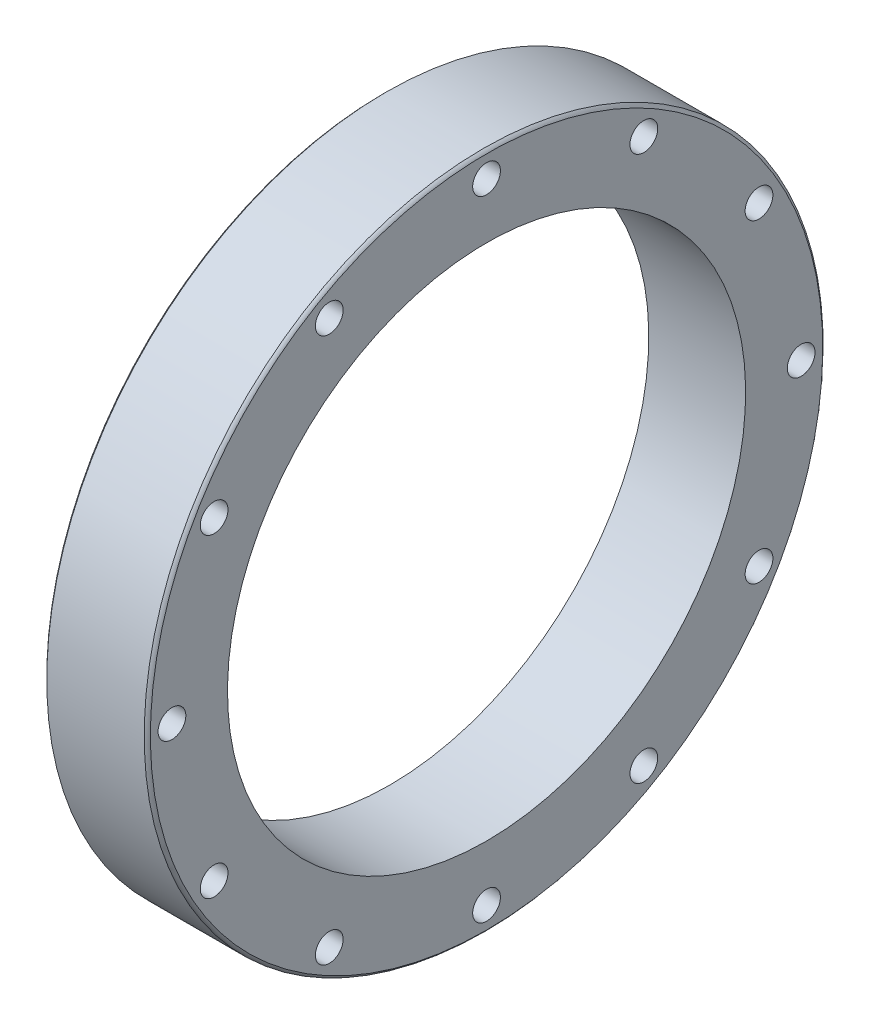
ISO-10303-21;
HEADER;
FILE_DESCRIPTION(('STEP AP214'),'2;1');
FILE_NAME('part.step','',(''),(''),'','','');
FILE_SCHEMA(('AUTOMOTIVE_DESIGN { 1 0 10303 214 1 1 1 1 }'));
ENDSEC;
DATA;
#1=APPLICATION_CONTEXT('core data for automotive mechanical design processes');
#2=APPLICATION_PROTOCOL_DEFINITION('international standard','automotive_design',2000,#1);
#3=PRODUCT_CONTEXT('',#1,'mechanical');
#4=PRODUCT('Part','Part','',(#3));
#5=PRODUCT_RELATED_PRODUCT_CATEGORY('part','',(#4));
#6=PRODUCT_DEFINITION_FORMATION('','',#4);
#7=PRODUCT_DEFINITION_CONTEXT('part definition',#1,'design');
#8=PRODUCT_DEFINITION('design','',#6,#7);
#9=PRODUCT_DEFINITION_SHAPE('','',#8);
#10=(LENGTH_UNIT() NAMED_UNIT(*) SI_UNIT(.MILLI.,.METRE.));
#11=(NAMED_UNIT(*) PLANE_ANGLE_UNIT() SI_UNIT($,.RADIAN.));
#12=(NAMED_UNIT(*) SI_UNIT($,.STERADIAN.) SOLID_ANGLE_UNIT());
#13=UNCERTAINTY_MEASURE_WITH_UNIT(LENGTH_MEASURE(1.E-05),#10,'distance_accuracy_value','');
#14=(GEOMETRIC_REPRESENTATION_CONTEXT(3) GLOBAL_UNCERTAINTY_ASSIGNED_CONTEXT((#13)) GLOBAL_UNIT_ASSIGNED_CONTEXT((#10,
#11,#12)) REPRESENTATION_CONTEXT('',''));
#15=CARTESIAN_POINT('',(0.,0.,0.));
#16=DIRECTION('',(0.,0.,1.));
#17=DIRECTION('',(1.,0.,0.));
#18=AXIS2_PLACEMENT_3D('',#15,#16,#17);
#19=CARTESIAN_POINT('',(-0.0100000000000013,0.,0.));
#20=DIRECTION('',(1.,0.,0.));
#21=DIRECTION('',(0.,0.,-1.));
#22=AXIS2_PLACEMENT_3D('',#19,#20,#21);
#23=CYLINDRICAL_SURFACE('',#22,41.9998270383694);
#24=CARTESIAN_POINT('',(0.999826901443189,0.,0.));
#25=DIRECTION('',(-1.,0.,0.));
#26=DIRECTION('',(0.,-1.,0.));
#27=AXIS2_PLACEMENT_3D('',#24,#25,#26);
#28=CIRCLE('',#27,41.9998270383694);
#29=CARTESIAN_POINT('',(0.999826901443194,-41.9998270383694,0.));
#30=VERTEX_POINT('',#29);
#31=EDGE_CURVE('E10',#30,#30,#28,.T.);
#32=ORIENTED_EDGE('',*,*,#31,.T.);
#33=EDGE_LOOP('',(#32));
#34=FACE_BOUND('',#33,.T.);
#35=CARTESIAN_POINT('',(16.6999999999792,0.,0.));
#36=DIRECTION('',(-1.,0.,0.));
#37=DIRECTION('',(0.,-1.,0.));
#38=AXIS2_PLACEMENT_3D('',#35,#36,#37);
#39=CIRCLE('',#38,41.9998270383694);
#40=CARTESIAN_POINT('',(16.6999999999792,-41.9998270383694,0.));
#41=VERTEX_POINT('',#40);
#42=EDGE_CURVE('E42',#41,#41,#39,.T.);
#43=ORIENTED_EDGE('',*,*,#42,.F.);
#44=EDGE_LOOP('',(#43));
#45=FACE_BOUND('',#44,.T.);
#46=ADVANCED_FACE('F32',(#34,#45),#23,.F.);
#47=CARTESIAN_POINT('',(0.,0.,0.));
#48=DIRECTION('',(-1.,0.,0.));
#49=DIRECTION('',(0.,-1.,0.));
#50=AXIS2_PLACEMENT_3D('',#47,#48,#49);
#51=CONICAL_SURFACE('',#50,43.9998270710618,0.785156092085935);
#52=CARTESIAN_POINT('',(0.499767872942841,0.,0.));
#53=DIRECTION('',(-1.,0.,0.));
#54=DIRECTION('',(0.,-1.,0.));
#55=AXIS2_PLACEMENT_3D('',#52,#53,#54);
#56=CIRCLE('',#55,43.5003010984954);
#57=CARTESIAN_POINT('',(0.499767872942847,-43.5003010984954,0.));
#58=VERTEX_POINT('',#57);
#59=EDGE_CURVE('E144',#58,#58,#56,.T.);
#60=ORIENTED_EDGE('',*,*,#59,.F.);
#61=EDGE_LOOP('',(#60));
#62=FACE_BOUND('',#61,.T.);
#63=CARTESIAN_POINT('',(0.,0.,0.));
#64=DIRECTION('',(-1.,0.,0.));
#65=DIRECTION('',(0.,-1.,0.));
#66=AXIS2_PLACEMENT_3D('',#63,#64,#65);
#67=CIRCLE('',#66,43.9998270710618);
#68=CARTESIAN_POINT('',(0.,-43.9998270710618,0.));
#69=VERTEX_POINT('',#68);
#70=EDGE_CURVE('E141',#69,#69,#67,.T.);
#71=ORIENTED_EDGE('',*,*,#70,.T.);
#72=EDGE_LOOP('',(#71));
#73=FACE_BOUND('',#72,.T.);
#74=ADVANCED_FACE('F234',(#62,#73),#51,.F.);
#75=CARTESIAN_POINT('',(-5.09999999999966,0.,0.));
#76=DIRECTION('',(-1.,0.,0.));
#77=DIRECTION('',(0.,-1.,0.));
#78=AXIS2_PLACEMENT_3D('',#75,#76,#77);
#79=CYLINDRICAL_SURFACE('',#78,43.5003010984954);
#80=CARTESIAN_POINT('',(3.45828430385802,0.,0.));
#81=DIRECTION('',(-1.,0.,0.));
#82=DIRECTION('',(0.,-1.,0.));
#83=AXIS2_PLACEMENT_3D('',#80,#81,#82);
#84=CIRCLE('',#83,43.5003010984954);
#85=CARTESIAN_POINT('',(3.45828430385802,-43.5003010984954,0.));
#86=VERTEX_POINT('',#85);
#87=EDGE_CURVE('E199',#86,#86,#84,.T.);
#88=ORIENTED_EDGE('',*,*,#87,.F.);
#89=EDGE_LOOP('',(#88));
#90=FACE_BOUND('',#89,.T.);
#91=ORIENTED_EDGE('',*,*,#59,.T.);
#92=EDGE_LOOP('',(#91));
#93=FACE_BOUND('',#92,.T.);
#94=ADVANCED_FACE('F238',(#90,#93),#79,.F.);
#95=CARTESIAN_POINT('',(3.45828430385802,0.,0.));
#96=DIRECTION('',(1.,0.,0.));
#97=DIRECTION('',(0.,1.,0.));
#98=AXIS2_PLACEMENT_3D('',#95,#96,#97);
#99=CONICAL_SURFACE('',#98,43.5003010984954,0.785427669859749);
#100=ORIENTED_EDGE('',*,*,#87,.T.);
#101=EDGE_LOOP('',(#100));
#102=FACE_BOUND('',#101,.T.);
#103=CARTESIAN_POINT('',(3.16999271419257,0.,0.));
#104=DIRECTION('',(1.,0.,0.));
#105=DIRECTION('',(0.,1.,0.));
#106=AXIS2_PLACEMENT_3D('',#103,#104,#105);
#107=CIRCLE('',#106,43.2119924953981);
#108=CARTESIAN_POINT('',(3.16999271419256,43.2119924953981,0.));
#109=VERTEX_POINT('',#108);
#110=EDGE_CURVE('E202',#109,#109,#107,.T.);
#111=ORIENTED_EDGE('',*,*,#110,.T.);
#112=EDGE_LOOP('',(#111));
#113=FACE_BOUND('',#112,.T.);
#114=ADVANCED_FACE('F213',(#102,#113),#99,.T.);
#115=CARTESIAN_POINT('',(3.38213100772368,0.,0.));
#116=DIRECTION('',(-1.,0.,0.));
#117=DIRECTION('',(0.,-1.,0.));
#118=AXIS2_PLACEMENT_3D('',#115,#116,#117);
#119=TOROIDAL_SURFACE('',#118,42.9998667203988,0.300000000002287);
#120=CARTESIAN_POINT('',(3.16999271419257,0.,0.));
#121=DIRECTION('',(-1.,0.,0.));
#122=DIRECTION('',(0.,-1.,0.));
#123=AXIS2_PLACEMENT_3D('',#120,#121,#122);
#124=CIRCLE('',#123,42.7877409453994);
#125=CARTESIAN_POINT('',(3.16999271419257,-42.7877409453994,0.));
#126=VERTEX_POINT('',#125);
#127=EDGE_CURVE('E205',#126,#126,#124,.F.);
#128=ORIENTED_EDGE('',*,*,#127,.T.);
#129=EDGE_LOOP('',(#128));
#130=FACE_BOUND('',#129,.T.);
#131=ORIENTED_EDGE('',*,*,#110,.F.);
#132=EDGE_LOOP('',(#131));
#133=FACE_BOUND('',#132,.T.);
#134=ADVANCED_FACE('F208',(#130,#133),#119,.T.);
#135=CARTESIAN_POINT('',(3.16999271419256,0.,0.));
#136=DIRECTION('',(-1.,0.,0.));
#137=DIRECTION('',(0.,-1.,0.));
#138=AXIS2_PLACEMENT_3D('',#135,#136,#137);
#139=CONICAL_SURFACE('',#138,42.7877409453994,0.785427669859771);
#140=CARTESIAN_POINT('',(3.45828430385801,0.,0.));
#141=DIRECTION('',(-1.,0.,0.));
#142=DIRECTION('',(0.,-1.,0.));
#143=AXIS2_PLACEMENT_3D('',#140,#141,#142);
#144=CIRCLE('',#143,42.4994323423021);
#145=CARTESIAN_POINT('',(3.45828430385802,-42.4994323423021,0.));
#146=VERTEX_POINT('',#145);
#147=EDGE_CURVE('E50',#146,#146,#144,.T.);
#148=ORIENTED_EDGE('',*,*,#147,.F.);
#149=EDGE_LOOP('',(#148));
#150=FACE_BOUND('',#149,.T.);
#151=ORIENTED_EDGE('',*,*,#127,.F.);
#152=EDGE_LOOP('',(#151));
#153=FACE_BOUND('',#152,.T.);
#154=ADVANCED_FACE('F212',(#150,#153),#139,.F.);
#155=CARTESIAN_POINT('',(-5.09999999999966,0.,0.));
#156=DIRECTION('',(-1.,0.,0.));
#157=DIRECTION('',(0.,-1.,0.));
#158=AXIS2_PLACEMENT_3D('',#155,#156,#157);
#159=CYLINDRICAL_SURFACE('',#158,42.4994323423021);
#160=CARTESIAN_POINT('',(0.999826901443188,0.,0.));
#161=DIRECTION('',(-1.,0.,0.));
#162=DIRECTION('',(0.,-1.,0.));
#163=AXIS2_PLACEMENT_3D('',#160,#161,#162);
#164=CIRCLE('',#163,42.4994323423021);
#165=CARTESIAN_POINT('',(0.999826901443193,-42.4994323423021,0.));
#166=VERTEX_POINT('',#165);
#167=EDGE_CURVE('E145',#166,#166,#164,.F.);
#168=ORIENTED_EDGE('',*,*,#167,.T.);
#169=EDGE_LOOP('',(#168));
#170=FACE_BOUND('',#169,.T.);
#171=ORIENTED_EDGE('',*,*,#147,.T.);
#172=EDGE_LOOP('',(#171));
#173=FACE_BOUND('',#172,.T.);
#174=ADVANCED_FACE('F218',(#170,#173),#159,.T.);
#175=CARTESIAN_POINT('',(0.999826901443189,0.,0.));
#176=DIRECTION('',(-1.,0.,0.));
#177=DIRECTION('',(0.,-1.,0.));
#178=AXIS2_PLACEMENT_3D('',#175,#176,#177);
#179=PLANE('',#178);
#180=ORIENTED_EDGE('',*,*,#31,.F.);
#181=EDGE_LOOP('',(#180));
#182=FACE_BOUND('',#181,.T.);
#183=ORIENTED_EDGE('',*,*,#167,.F.);
#184=EDGE_LOOP('',(#183));
#185=FACE_BOUND('',#184,.T.);
#186=ADVANCED_FACE('F221',(#182,#185),#179,.T.);
#187=CARTESIAN_POINT('',(0.,0.,0.));
#188=DIRECTION('',(1.,0.,0.));
#189=DIRECTION('',(0.,1.,0.));
#190=AXIS2_PLACEMENT_3D('',#187,#188,#189);
#191=PLANE('',#190);
#192=CARTESIAN_POINT('',(0.,0.,0.));
#193=DIRECTION('',(-1.,0.,0.));
#194=DIRECTION('',(0.,-1.,0.));
#195=AXIS2_PLACEMENT_3D('',#192,#193,#194);
#196=CIRCLE('',#195,44.9998270710616);
#197=CARTESIAN_POINT('',(0.,-44.9998270710616,0.));
#198=VERTEX_POINT('',#197);
#199=EDGE_CURVE('E138',#198,#198,#196,.F.);
#200=ORIENTED_EDGE('',*,*,#199,.F.);
#201=EDGE_LOOP('',(#200));
#202=FACE_BOUND('',#201,.T.);
#203=ORIENTED_EDGE('',*,*,#70,.F.);
#204=EDGE_LOOP('',(#203));
#205=FACE_BOUND('',#204,.T.);
#206=ADVANCED_FACE('F224',(#202,#205),#191,.F.);
#207=CARTESIAN_POINT('',(-5.09999999999966,0.,0.));
#208=DIRECTION('',(-1.,0.,0.));
#209=DIRECTION('',(0.,-1.,0.));
#210=AXIS2_PLACEMENT_3D('',#207,#208,#209);
#211=CYLINDRICAL_SURFACE('',#210,44.9998270710616);
#212=ORIENTED_EDGE('',*,*,#199,.T.);
#213=EDGE_LOOP('',(#212));
#214=FACE_BOUND('',#213,.T.);
#215=CARTESIAN_POINT('',(1.3500000000013,0.,0.));
#216=DIRECTION('',(-1.,0.,0.));
#217=DIRECTION('',(0.,-1.,0.));
#218=AXIS2_PLACEMENT_3D('',#215,#216,#217);
#219=CIRCLE('',#218,44.9998270710616);
#220=CARTESIAN_POINT('',(1.3500000000013,-44.9998270710616,0.));
#221=VERTEX_POINT('',#220);
#222=EDGE_CURVE('E135',#221,#221,#219,.T.);
#223=ORIENTED_EDGE('',*,*,#222,.T.);
#224=EDGE_LOOP('',(#223));
#225=FACE_BOUND('',#224,.T.);
#226=ADVANCED_FACE('F229',(#214,#225),#211,.T.);
#227=CARTESIAN_POINT('',(1.3500000000013,0.,0.));
#228=DIRECTION('',(1.,0.,0.));
#229=DIRECTION('',(0.,1.,0.));
#230=AXIS2_PLACEMENT_3D('',#227,#228,#229);
#231=PLANE('',#230);
#232=CARTESIAN_POINT('',(1.3500000000013,0.,0.));
#233=DIRECTION('',(-1.,0.,0.));
#234=DIRECTION('',(0.,-1.,0.));
#235=AXIS2_PLACEMENT_3D('',#232,#233,#234);
#236=CIRCLE('',#235,47.3998270710615);
#237=CARTESIAN_POINT('',(1.35000000000131,-47.3998270710615,0.));
#238=VERTEX_POINT('',#237);
#239=EDGE_CURVE('E132',#238,#238,#236,.T.);
#240=ORIENTED_EDGE('',*,*,#239,.T.);
#241=EDGE_LOOP('',(#240));
#242=FACE_BOUND('',#241,.T.);
#243=ORIENTED_EDGE('',*,*,#222,.F.);
#244=EDGE_LOOP('',(#243));
#245=FACE_BOUND('',#244,.T.);
#246=ADVANCED_FACE('F333',(#242,#245),#231,.F.);
#247=CARTESIAN_POINT('',(-5.09999999999966,0.,0.));
#248=DIRECTION('',(-1.,0.,0.));
#249=DIRECTION('',(0.,-1.,0.));
#250=AXIS2_PLACEMENT_3D('',#247,#248,#249);
#251=CYLINDRICAL_SURFACE('',#250,47.3998270710615);
#252=CARTESIAN_POINT('',(0.,0.,0.));
#253=DIRECTION('',(-1.,0.,0.));
#254=DIRECTION('',(0.,-1.,0.));
#255=AXIS2_PLACEMENT_3D('',#252,#253,#254);
#256=CIRCLE('',#255,47.3998270710615);
#257=CARTESIAN_POINT('',(0.,-47.3998270710615,0.));
#258=VERTEX_POINT('',#257);
#259=EDGE_CURVE('E129',#258,#258,#256,.F.);
#260=ORIENTED_EDGE('',*,*,#259,.F.);
#261=EDGE_LOOP('',(#260));
#262=FACE_BOUND('',#261,.T.);
#263=ORIENTED_EDGE('',*,*,#239,.F.);
#264=EDGE_LOOP('',(#263));
#265=FACE_BOUND('',#264,.T.);
#266=ADVANCED_FACE('F329',(#262,#265),#251,.F.);
#267=CARTESIAN_POINT('',(0.400000000000738,0.,0.));
#268=DIRECTION('',(1.,0.,0.));
#269=DIRECTION('',(0.,1.,0.));
#270=AXIS2_PLACEMENT_3D('',#267,#268,#269);
#271=CONICAL_SURFACE('',#270,54.9998270710621,0.785398163397448);
#272=CARTESIAN_POINT('',(0.,0.,0.));
#273=DIRECTION('',(1.,0.,0.));
#274=DIRECTION('',(0.,1.,0.));
#275=AXIS2_PLACEMENT_3D('',#272,#273,#274);
#276=CIRCLE('',#275,54.5998270710614);
#277=CARTESIAN_POINT('',(0.,54.5998270710614,0.));
#278=VERTEX_POINT('',#277);
#279=EDGE_CURVE('E126',#278,#278,#276,.F.);
#280=ORIENTED_EDGE('',*,*,#279,.F.);
#281=EDGE_LOOP('',(#280));
#282=FACE_BOUND('',#281,.T.);
#283=CARTESIAN_POINT('',(0.400000000000737,0.,0.));
#284=DIRECTION('',(-1.,0.,0.));
#285=DIRECTION('',(0.,-1.,0.));
#286=AXIS2_PLACEMENT_3D('',#283,#284,#285);
#287=CIRCLE('',#286,54.9998270710621);
#288=CARTESIAN_POINT('',(0.400000000000743,-54.9998270710621,0.));
#289=VERTEX_POINT('',#288);
#290=EDGE_CURVE('E125',#289,#289,#287,.F.);
#291=ORIENTED_EDGE('',*,*,#290,.F.);
#292=EDGE_LOOP('',(#291));
#293=FACE_BOUND('',#292,.T.);
#294=ADVANCED_FACE('F280',(#282,#293),#271,.T.);
#295=CARTESIAN_POINT('',(0.,0.,0.));
#296=DIRECTION('',(-1.,0.,0.));
#297=DIRECTION('',(0.,-1.,0.));
#298=AXIS2_PLACEMENT_3D('',#295,#296,#297);
#299=PLANE('',#298);
#300=CARTESIAN_POINT('',(0.,44.1672955930067,25.4999999999994));
#301=DIRECTION('',(1.,0.,0.));
#302=DIRECTION('',(0.,0.,-1.));
#303=AXIS2_PLACEMENT_3D('',#300,#301,#302);
#304=CIRCLE('',#303,2.25);
#305=CARTESIAN_POINT('',(0.,44.1672955930067,23.2499999999994));
#306=VERTEX_POINT('',#305);
#307=EDGE_CURVE('E122',#306,#306,#304,.T.);
#308=ORIENTED_EDGE('',*,*,#307,.T.);
#309=EDGE_LOOP('',(#308));
#310=FACE_BOUND('',#309,.T.);
#311=CARTESIAN_POINT('',(0.,25.5000000000005,44.1672955930061));
#312=DIRECTION('',(1.,0.,0.));
#313=DIRECTION('',(0.,0.,-1.));
#314=AXIS2_PLACEMENT_3D('',#311,#312,#313);
#315=CIRCLE('',#314,2.25);
#316=CARTESIAN_POINT('',(0.,25.5000000000005,41.9172955930061));
#317=VERTEX_POINT('',#316);
#318=EDGE_CURVE('E119',#317,#317,#315,.T.);
#319=ORIENTED_EDGE('',*,*,#318,.T.);
#320=EDGE_LOOP('',(#319));
#321=FACE_BOUND('',#320,.T.);
#322=CARTESIAN_POINT('',(0.,-25.4999999999996,44.1672955930066));
#323=DIRECTION('',(1.,0.,0.));
#324=DIRECTION('',(0.,0.,-1.));
#325=AXIS2_PLACEMENT_3D('',#322,#323,#324);
#326=CIRCLE('',#325,2.25);
#327=CARTESIAN_POINT('',(0.,-25.4999999999996,41.9172955930066));
#328=VERTEX_POINT('',#327);
#329=EDGE_CURVE('E113',#328,#328,#326,.T.);
#330=ORIENTED_EDGE('',*,*,#329,.T.);
#331=EDGE_LOOP('',(#330));
#332=FACE_BOUND('',#331,.T.);
#333=CARTESIAN_POINT('',(0.,-51.,0.));
#334=DIRECTION('',(1.,0.,0.));
#335=DIRECTION('',(0.,0.,-1.));
#336=AXIS2_PLACEMENT_3D('',#333,#334,#335);
#337=CIRCLE('',#336,2.25);
#338=CARTESIAN_POINT('',(0.,-51.,-2.25));
#339=VERTEX_POINT('',#338);
#340=EDGE_CURVE('E107',#339,#339,#337,.T.);
#341=ORIENTED_EDGE('',*,*,#340,.T.);
#342=EDGE_LOOP('',(#341));
#343=FACE_BOUND('',#342,.T.);
#344=CARTESIAN_POINT('',(0.,-25.5000000000002,-44.1672955930063));
#345=DIRECTION('',(1.,0.,0.));
#346=DIRECTION('',(0.,0.,-1.));
#347=AXIS2_PLACEMENT_3D('',#344,#345,#346);
#348=CIRCLE('',#347,2.25);
#349=CARTESIAN_POINT('',(0.,-25.5000000000002,-46.4172955930063));
#350=VERTEX_POINT('',#349);
#351=EDGE_CURVE('E101',#350,#350,#348,.T.);
#352=ORIENTED_EDGE('',*,*,#351,.T.);
#353=EDGE_LOOP('',(#352));
#354=FACE_BOUND('',#353,.T.);
#355=CARTESIAN_POINT('',(0.,-1.76240040415972E-13,-51.));
#356=DIRECTION('',(1.,0.,0.));
#357=DIRECTION('',(0.,0.,-1.));
#358=AXIS2_PLACEMENT_3D('',#355,#356,#357);
#359=CIRCLE('',#358,2.25);
#360=CARTESIAN_POINT('',(0.,-1.76240040415972E-13,-53.25));
#361=VERTEX_POINT('',#360);
#362=EDGE_CURVE('E98',#361,#361,#359,.T.);
#363=ORIENTED_EDGE('',*,*,#362,.T.);
#364=EDGE_LOOP('',(#363));
#365=FACE_BOUND('',#364,.T.);
#366=CARTESIAN_POINT('',(0.,25.4999999999999,-44.1672955930064));
#367=DIRECTION('',(1.,0.,0.));
#368=DIRECTION('',(0.,0.,-1.));
#369=AXIS2_PLACEMENT_3D('',#366,#367,#368);
#370=CIRCLE('',#369,2.25);
#371=CARTESIAN_POINT('',(0.,25.4999999999999,-46.4172955930064));
#372=VERTEX_POINT('',#371);
#373=EDGE_CURVE('E95',#372,#372,#370,.T.);
#374=ORIENTED_EDGE('',*,*,#373,.T.);
#375=EDGE_LOOP('',(#374));
#376=FACE_BOUND('',#375,.T.);
#377=CARTESIAN_POINT('',(0.,44.1672955930064,-25.5));
#378=DIRECTION('',(1.,0.,0.));
#379=DIRECTION('',(0.,0.,-1.));
#380=AXIS2_PLACEMENT_3D('',#377,#378,#379);
#381=CIRCLE('',#380,2.25);
#382=CARTESIAN_POINT('',(0.,44.1672955930064,-27.75));
#383=VERTEX_POINT('',#382);
#384=EDGE_CURVE('E92',#383,#383,#381,.T.);
#385=ORIENTED_EDGE('',*,*,#384,.T.);
#386=EDGE_LOOP('',(#385));
#387=FACE_BOUND('',#386,.T.);
#388=CARTESIAN_POINT('',(0.,51.,0.));
#389=DIRECTION('',(1.,0.,0.));
#390=DIRECTION('',(0.,0.,-1.));
#391=AXIS2_PLACEMENT_3D('',#388,#389,#390);
#392=CIRCLE('',#391,2.25);
#393=CARTESIAN_POINT('',(0.,51.,-2.25));
#394=VERTEX_POINT('',#393);
#395=EDGE_CURVE('E89',#394,#394,#392,.T.);
#396=ORIENTED_EDGE('',*,*,#395,.T.);
#397=EDGE_LOOP('',(#396));
#398=FACE_BOUND('',#397,.T.);
#399=ORIENTED_EDGE('',*,*,#279,.T.);
#400=EDGE_LOOP('',(#399));
#401=FACE_BOUND('',#400,.T.);
#402=ORIENTED_EDGE('',*,*,#259,.T.);
#403=EDGE_LOOP('',(#402));
#404=FACE_BOUND('',#403,.T.);
#405=CARTESIAN_POINT('',(0.,-44.1672955930065,-25.4999999999997));
#406=DIRECTION('',(1.,0.,0.));
#407=DIRECTION('',(0.,0.,-1.));
#408=AXIS2_PLACEMENT_3D('',#405,#406,#407);
#409=CIRCLE('',#408,2.25);
#410=CARTESIAN_POINT('',(0.,-44.1672955930065,-27.7499999999997));
#411=VERTEX_POINT('',#410);
#412=EDGE_CURVE('E104',#411,#411,#409,.T.);
#413=ORIENTED_EDGE('',*,*,#412,.T.);
#414=EDGE_LOOP('',(#413));
#415=FACE_BOUND('',#414,.T.);
#416=CARTESIAN_POINT('',(0.,-44.1672955930062,25.5000000000004));
#417=DIRECTION('',(1.,0.,0.));
#418=DIRECTION('',(0.,0.,-1.));
#419=AXIS2_PLACEMENT_3D('',#416,#417,#418);
#420=CIRCLE('',#419,2.25);
#421=CARTESIAN_POINT('',(0.,-44.1672955930062,23.2500000000004));
#422=VERTEX_POINT('',#421);
#423=EDGE_CURVE('E110',#422,#422,#420,.T.);
#424=ORIENTED_EDGE('',*,*,#423,.T.);
#425=EDGE_LOOP('',(#424));
#426=FACE_BOUND('',#425,.T.);
#427=CARTESIAN_POINT('',(0.,5.36022152708027E-13,51.));
#428=DIRECTION('',(1.,0.,0.));
#429=DIRECTION('',(0.,0.,-1.));
#430=AXIS2_PLACEMENT_3D('',#427,#428,#429);
#431=CIRCLE('',#430,2.25);
#432=CARTESIAN_POINT('',(0.,5.36022152708027E-13,48.75));
#433=VERTEX_POINT('',#432);
#434=EDGE_CURVE('E116',#433,#433,#431,.T.);
#435=ORIENTED_EDGE('',*,*,#434,.T.);
#436=EDGE_LOOP('',(#435));
#437=FACE_BOUND('',#436,.T.);
#438=ADVANCED_FACE('F277',(#310,#321,#332,#343,#354,#365,#376,#387,#398,#401,#404,#415,#426,
#437),#299,.T.);
#439=CARTESIAN_POINT('',(-5.09999999999966,0.,0.));
#440=DIRECTION('',(-1.,0.,0.));
#441=DIRECTION('',(0.,-1.,0.));
#442=AXIS2_PLACEMENT_3D('',#439,#440,#441);
#443=CYLINDRICAL_SURFACE('',#442,54.9998270710621);
#444=CARTESIAN_POINT('',(16.1999999999919,0.,0.));
#445=DIRECTION('',(-1.,0.,0.));
#446=DIRECTION('',(0.,-1.,0.));
#447=AXIS2_PLACEMENT_3D('',#444,#445,#446);
#448=CIRCLE('',#447,54.9998270710621);
#449=CARTESIAN_POINT('',(16.1999999999919,-54.9998270710621,0.));
#450=VERTEX_POINT('',#449);
#451=EDGE_CURVE('E88',#450,#450,#448,.F.);
#452=ORIENTED_EDGE('',*,*,#451,.F.);
#453=EDGE_LOOP('',(#452));
#454=FACE_BOUND('',#453,.T.);
#455=ORIENTED_EDGE('',*,*,#290,.T.);
#456=EDGE_LOOP('',(#455));
#457=FACE_BOUND('',#456,.T.);
#458=ADVANCED_FACE('F273',(#454,#457),#443,.T.);
#459=CARTESIAN_POINT('',(16.6999999999792,44.1672955930067,25.4999999999994));
#460=DIRECTION('',(1.,0.,0.));
#461=DIRECTION('',(0.,0.,-1.));
#462=AXIS2_PLACEMENT_3D('',#459,#460,#461);
#463=CYLINDRICAL_SURFACE('',#462,2.25);
#464=CARTESIAN_POINT('',(16.6999999999792,44.1672955930067,25.4999999999994));
#465=DIRECTION('',(1.,0.,0.));
#466=DIRECTION('',(0.,0.,-1.));
#467=AXIS2_PLACEMENT_3D('',#464,#465,#466);
#468=CIRCLE('',#467,2.25);
#469=CARTESIAN_POINT('',(16.6999999999792,44.1672955930067,23.2499999999994));
#470=VERTEX_POINT('',#469);
#471=EDGE_CURVE('E85',#470,#470,#468,.F.);
#472=ORIENTED_EDGE('',*,*,#471,.F.);
#473=EDGE_LOOP('',(#472));
#474=FACE_BOUND('',#473,.T.);
#475=ORIENTED_EDGE('',*,*,#307,.F.);
#476=EDGE_LOOP('',(#475));
#477=FACE_BOUND('',#476,.T.);
#478=ADVANCED_FACE('F269',(#474,#477),#463,.F.);
#479=CARTESIAN_POINT('',(16.6999999999792,25.5000000000005,44.1672955930061));
#480=DIRECTION('',(1.,0.,0.));
#481=DIRECTION('',(0.,0.,-1.));
#482=AXIS2_PLACEMENT_3D('',#479,#480,#481);
#483=CYLINDRICAL_SURFACE('',#482,2.25);
#484=CARTESIAN_POINT('',(16.6999999999792,25.5000000000005,44.1672955930061));
#485=DIRECTION('',(1.,0.,0.));
#486=DIRECTION('',(0.,0.,-1.));
#487=AXIS2_PLACEMENT_3D('',#484,#485,#486);
#488=CIRCLE('',#487,2.25);
#489=CARTESIAN_POINT('',(16.6999999999792,25.5000000000005,41.9172955930061));
#490=VERTEX_POINT('',#489);
#491=EDGE_CURVE('E82',#490,#490,#488,.F.);
#492=ORIENTED_EDGE('',*,*,#491,.F.);
#493=EDGE_LOOP('',(#492));
#494=FACE_BOUND('',#493,.T.);
#495=ORIENTED_EDGE('',*,*,#318,.F.);
#496=EDGE_LOOP('',(#495));
#497=FACE_BOUND('',#496,.T.);
#498=ADVANCED_FACE('F272',(#494,#497),#483,.F.);
#499=CARTESIAN_POINT('',(16.6999999999792,5.36022152708027E-13,51.));
#500=DIRECTION('',(1.,0.,0.));
#501=DIRECTION('',(0.,0.,-1.));
#502=AXIS2_PLACEMENT_3D('',#499,#500,#501);
#503=CYLINDRICAL_SURFACE('',#502,2.25);
#504=CARTESIAN_POINT('',(16.6999999999792,5.36022152708027E-13,51.));
#505=DIRECTION('',(1.,0.,0.));
#506=DIRECTION('',(0.,0.,-1.));
#507=AXIS2_PLACEMENT_3D('',#504,#505,#506);
#508=CIRCLE('',#507,2.25);
#509=CARTESIAN_POINT('',(16.6999999999792,5.36022152708027E-13,48.75));
#510=VERTEX_POINT('',#509);
#511=EDGE_CURVE('E79',#510,#510,#508,.F.);
#512=ORIENTED_EDGE('',*,*,#511,.F.);
#513=EDGE_LOOP('',(#512));
#514=FACE_BOUND('',#513,.T.);
#515=ORIENTED_EDGE('',*,*,#434,.F.);
#516=EDGE_LOOP('',(#515));
#517=FACE_BOUND('',#516,.T.);
#518=ADVANCED_FACE('F308',(#514,#517),#503,.F.);
#519=CARTESIAN_POINT('',(16.6999999999792,-25.4999999999996,44.1672955930066));
#520=DIRECTION('',(1.,0.,0.));
#521=DIRECTION('',(0.,0.,-1.));
#522=AXIS2_PLACEMENT_3D('',#519,#520,#521);
#523=CYLINDRICAL_SURFACE('',#522,2.25);
#524=CARTESIAN_POINT('',(16.6999999999792,-25.4999999999996,44.1672955930066));
#525=DIRECTION('',(1.,0.,0.));
#526=DIRECTION('',(0.,0.,-1.));
#527=AXIS2_PLACEMENT_3D('',#524,#525,#526);
#528=CIRCLE('',#527,2.25);
#529=CARTESIAN_POINT('',(16.6999999999792,-25.4999999999996,41.9172955930066));
#530=VERTEX_POINT('',#529);
#531=EDGE_CURVE('E76',#530,#530,#528,.F.);
#532=ORIENTED_EDGE('',*,*,#531,.F.);
#533=EDGE_LOOP('',(#532));
#534=FACE_BOUND('',#533,.T.);
#535=ORIENTED_EDGE('',*,*,#329,.F.);
#536=EDGE_LOOP('',(#535));
#537=FACE_BOUND('',#536,.T.);
#538=ADVANCED_FACE('F310',(#534,#537),#523,.F.);
#539=CARTESIAN_POINT('',(16.6999999999792,-44.1672955930062,25.5000000000004));
#540=DIRECTION('',(1.,0.,0.));
#541=DIRECTION('',(0.,0.,-1.));
#542=AXIS2_PLACEMENT_3D('',#539,#540,#541);
#543=CYLINDRICAL_SURFACE('',#542,2.25);
#544=CARTESIAN_POINT('',(16.6999999999792,-44.1672955930062,25.5000000000004));
#545=DIRECTION('',(1.,0.,0.));
#546=DIRECTION('',(0.,0.,-1.));
#547=AXIS2_PLACEMENT_3D('',#544,#545,#546);
#548=CIRCLE('',#547,2.25);
#549=CARTESIAN_POINT('',(16.6999999999792,-44.1672955930062,23.2500000000004));
#550=VERTEX_POINT('',#549);
#551=EDGE_CURVE('E73',#550,#550,#548,.F.);
#552=ORIENTED_EDGE('',*,*,#551,.F.);
#553=EDGE_LOOP('',(#552));
#554=FACE_BOUND('',#553,.T.);
#555=ORIENTED_EDGE('',*,*,#423,.F.);
#556=EDGE_LOOP('',(#555));
#557=FACE_BOUND('',#556,.T.);
#558=ADVANCED_FACE('F317',(#554,#557),#543,.F.);
#559=CARTESIAN_POINT('',(16.6999999999792,-51.,0.));
#560=DIRECTION('',(1.,0.,0.));
#561=DIRECTION('',(0.,0.,-1.));
#562=AXIS2_PLACEMENT_3D('',#559,#560,#561);
#563=CYLINDRICAL_SURFACE('',#562,2.25);
#564=CARTESIAN_POINT('',(16.6999999999792,-51.,0.));
#565=DIRECTION('',(1.,0.,0.));
#566=DIRECTION('',(0.,0.,-1.));
#567=AXIS2_PLACEMENT_3D('',#564,#565,#566);
#568=CIRCLE('',#567,2.25);
#569=CARTESIAN_POINT('',(16.6999999999792,-51.,-2.25));
#570=VERTEX_POINT('',#569);
#571=EDGE_CURVE('E70',#570,#570,#568,.F.);
#572=ORIENTED_EDGE('',*,*,#571,.F.);
#573=EDGE_LOOP('',(#572));
#574=FACE_BOUND('',#573,.T.);
#575=ORIENTED_EDGE('',*,*,#340,.F.);
#576=EDGE_LOOP('',(#575));
#577=FACE_BOUND('',#576,.T.);
#578=ADVANCED_FACE('F453',(#574,#577),#563,.F.);
#579=CARTESIAN_POINT('',(16.6999999999792,-44.1672955930065,-25.4999999999997));
#580=DIRECTION('',(1.,0.,0.));
#581=DIRECTION('',(0.,0.,-1.));
#582=AXIS2_PLACEMENT_3D('',#579,#580,#581);
#583=CYLINDRICAL_SURFACE('',#582,2.25);
#584=CARTESIAN_POINT('',(16.6999999999792,-44.1672955930065,-25.4999999999997));
#585=DIRECTION('',(1.,0.,0.));
#586=DIRECTION('',(0.,0.,-1.));
#587=AXIS2_PLACEMENT_3D('',#584,#585,#586);
#588=CIRCLE('',#587,2.25);
#589=CARTESIAN_POINT('',(16.6999999999792,-44.1672955930065,-27.7499999999997));
#590=VERTEX_POINT('',#589);
#591=EDGE_CURVE('E67',#590,#590,#588,.F.);
#592=ORIENTED_EDGE('',*,*,#591,.F.);
#593=EDGE_LOOP('',(#592));
#594=FACE_BOUND('',#593,.T.);
#595=ORIENTED_EDGE('',*,*,#412,.F.);
#596=EDGE_LOOP('',(#595));
#597=FACE_BOUND('',#596,.T.);
#598=ADVANCED_FACE('F462',(#594,#597),#583,.F.);
#599=CARTESIAN_POINT('',(16.6999999999792,-25.5000000000002,-44.1672955930063));
#600=DIRECTION('',(1.,0.,0.));
#601=DIRECTION('',(0.,0.,-1.));
#602=AXIS2_PLACEMENT_3D('',#599,#600,#601);
#603=CYLINDRICAL_SURFACE('',#602,2.25);
#604=CARTESIAN_POINT('',(16.6999999999792,-25.5000000000002,-44.1672955930063));
#605=DIRECTION('',(1.,0.,0.));
#606=DIRECTION('',(0.,0.,-1.));
#607=AXIS2_PLACEMENT_3D('',#604,#605,#606);
#608=CIRCLE('',#607,2.25);
#609=CARTESIAN_POINT('',(16.6999999999792,-25.5000000000002,-46.4172955930063));
#610=VERTEX_POINT('',#609);
#611=EDGE_CURVE('E64',#610,#610,#608,.F.);
#612=ORIENTED_EDGE('',*,*,#611,.F.);
#613=EDGE_LOOP('',(#612));
#614=FACE_BOUND('',#613,.T.);
#615=ORIENTED_EDGE('',*,*,#351,.F.);
#616=EDGE_LOOP('',(#615));
#617=FACE_BOUND('',#616,.T.);
#618=ADVANCED_FACE('F472',(#614,#617),#603,.F.);
#619=CARTESIAN_POINT('',(16.6999999999792,-1.76240040415972E-13,-51.));
#620=DIRECTION('',(1.,0.,0.));
#621=DIRECTION('',(0.,0.,-1.));
#622=AXIS2_PLACEMENT_3D('',#619,#620,#621);
#623=CYLINDRICAL_SURFACE('',#622,2.25);
#624=CARTESIAN_POINT('',(16.6999999999792,-1.76240040415972E-13,-51.));
#625=DIRECTION('',(1.,0.,0.));
#626=DIRECTION('',(0.,0.,-1.));
#627=AXIS2_PLACEMENT_3D('',#624,#625,#626);
#628=CIRCLE('',#627,2.25);
#629=CARTESIAN_POINT('',(16.6999999999792,-1.76240040415972E-13,-53.25));
#630=VERTEX_POINT('',#629);
#631=EDGE_CURVE('E61',#630,#630,#628,.F.);
#632=ORIENTED_EDGE('',*,*,#631,.F.);
#633=EDGE_LOOP('',(#632));
#634=FACE_BOUND('',#633,.T.);
#635=ORIENTED_EDGE('',*,*,#362,.F.);
#636=EDGE_LOOP('',(#635));
#637=FACE_BOUND('',#636,.T.);
#638=ADVANCED_FACE('F482',(#634,#637),#623,.F.);
#639=CARTESIAN_POINT('',(16.6999999999792,25.4999999999999,-44.1672955930064));
#640=DIRECTION('',(1.,0.,0.));
#641=DIRECTION('',(0.,0.,-1.));
#642=AXIS2_PLACEMENT_3D('',#639,#640,#641);
#643=CYLINDRICAL_SURFACE('',#642,2.25);
#644=CARTESIAN_POINT('',(16.6999999999792,25.4999999999999,-44.1672955930064));
#645=DIRECTION('',(1.,0.,0.));
#646=DIRECTION('',(0.,0.,-1.));
#647=AXIS2_PLACEMENT_3D('',#644,#645,#646);
#648=CIRCLE('',#647,2.25);
#649=CARTESIAN_POINT('',(16.6999999999792,25.4999999999999,-46.4172955930064));
#650=VERTEX_POINT('',#649);
#651=EDGE_CURVE('E58',#650,#650,#648,.F.);
#652=ORIENTED_EDGE('',*,*,#651,.F.);
#653=EDGE_LOOP('',(#652));
#654=FACE_BOUND('',#653,.T.);
#655=ORIENTED_EDGE('',*,*,#373,.F.);
#656=EDGE_LOOP('',(#655));
#657=FACE_BOUND('',#656,.T.);
#658=ADVANCED_FACE('F492',(#654,#657),#643,.F.);
#659=CARTESIAN_POINT('',(16.6999999999792,44.1672955930064,-25.5));
#660=DIRECTION('',(1.,0.,0.));
#661=DIRECTION('',(0.,0.,-1.));
#662=AXIS2_PLACEMENT_3D('',#659,#660,#661);
#663=CYLINDRICAL_SURFACE('',#662,2.25);
#664=CARTESIAN_POINT('',(16.6999999999792,44.1672955930064,-25.5));
#665=DIRECTION('',(1.,0.,0.));
#666=DIRECTION('',(0.,0.,-1.));
#667=AXIS2_PLACEMENT_3D('',#664,#665,#666);
#668=CIRCLE('',#667,2.25);
#669=CARTESIAN_POINT('',(16.6999999999792,44.1672955930064,-27.75));
#670=VERTEX_POINT('',#669);
#671=EDGE_CURVE('E55',#670,#670,#668,.F.);
#672=ORIENTED_EDGE('',*,*,#671,.F.);
#673=EDGE_LOOP('',(#672));
#674=FACE_BOUND('',#673,.T.);
#675=ORIENTED_EDGE('',*,*,#384,.F.);
#676=EDGE_LOOP('',(#675));
#677=FACE_BOUND('',#676,.T.);
#678=ADVANCED_FACE('F502',(#674,#677),#663,.F.);
#679=CARTESIAN_POINT('',(16.6999999999792,51.,0.));
#680=DIRECTION('',(1.,0.,0.));
#681=DIRECTION('',(0.,0.,-1.));
#682=AXIS2_PLACEMENT_3D('',#679,#680,#681);
#683=CYLINDRICAL_SURFACE('',#682,2.25);
#684=CARTESIAN_POINT('',(16.6999999999792,51.,0.));
#685=DIRECTION('',(1.,0.,0.));
#686=DIRECTION('',(0.,0.,-1.));
#687=AXIS2_PLACEMENT_3D('',#684,#685,#686);
#688=CIRCLE('',#687,2.25);
#689=CARTESIAN_POINT('',(16.6999999999792,51.,-2.25));
#690=VERTEX_POINT('',#689);
#691=EDGE_CURVE('E47',#690,#690,#688,.F.);
#692=ORIENTED_EDGE('',*,*,#691,.F.);
#693=EDGE_LOOP('',(#692));
#694=FACE_BOUND('',#693,.T.);
#695=ORIENTED_EDGE('',*,*,#395,.F.);
#696=EDGE_LOOP('',(#695));
#697=FACE_BOUND('',#696,.T.);
#698=ADVANCED_FACE('F188',(#694,#697),#683,.F.);
#699=CARTESIAN_POINT('',(15.4192235962526,0.,0.));
#700=DIRECTION('',(-1.,0.,0.));
#701=DIRECTION('',(0.,-1.,0.));
#702=AXIS2_PLACEMENT_3D('',#699,#700,#701);
#703=TOROIDAL_SURFACE('',#702,53.7190506630336,1.49999999999956);
#704=CARTESIAN_POINT('',(16.6999999999792,0.,0.));
#705=DIRECTION('',(-1.,0.,0.));
#706=DIRECTION('',(0.,-1.,0.));
#707=AXIS2_PLACEMENT_3D('',#704,#705,#706);
#708=CIRCLE('',#707,54.4998270738298);
#709=CARTESIAN_POINT('',(16.6999999999792,-54.4998270738298,0.));
#710=VERTEX_POINT('',#709);
#711=EDGE_CURVE('E38',#710,#710,#708,.F.);
#712=ORIENTED_EDGE('',*,*,#711,.F.);
#713=EDGE_LOOP('',(#712));
#714=FACE_BOUND('',#713,.T.);
#715=ORIENTED_EDGE('',*,*,#451,.T.);
#716=EDGE_LOOP('',(#715));
#717=FACE_BOUND('',#716,.T.);
#718=ADVANCED_FACE('F185',(#714,#717),#703,.T.);
#719=CARTESIAN_POINT('',(16.6999999999792,0.,0.));
#720=DIRECTION('',(1.,0.,0.));
#721=DIRECTION('',(0.,1.,0.));
#722=AXIS2_PLACEMENT_3D('',#719,#720,#721);
#723=PLANE('',#722);
#724=ORIENTED_EDGE('',*,*,#711,.T.);
#725=EDGE_LOOP('',(#724));
#726=FACE_BOUND('',#725,.T.);
#727=ORIENTED_EDGE('',*,*,#42,.T.);
#728=EDGE_LOOP('',(#727));
#729=FACE_BOUND('',#728,.T.);
#730=ORIENTED_EDGE('',*,*,#691,.T.);
#731=EDGE_LOOP('',(#730));
#732=FACE_BOUND('',#731,.T.);
#733=ORIENTED_EDGE('',*,*,#671,.T.);
#734=EDGE_LOOP('',(#733));
#735=FACE_BOUND('',#734,.T.);
#736=ORIENTED_EDGE('',*,*,#651,.T.);
#737=EDGE_LOOP('',(#736));
#738=FACE_BOUND('',#737,.T.);
#739=ORIENTED_EDGE('',*,*,#631,.T.);
#740=EDGE_LOOP('',(#739));
#741=FACE_BOUND('',#740,.T.);
#742=ORIENTED_EDGE('',*,*,#611,.T.);
#743=EDGE_LOOP('',(#742));
#744=FACE_BOUND('',#743,.T.);
#745=ORIENTED_EDGE('',*,*,#591,.T.);
#746=EDGE_LOOP('',(#745));
#747=FACE_BOUND('',#746,.T.);
#748=ORIENTED_EDGE('',*,*,#571,.T.);
#749=EDGE_LOOP('',(#748));
#750=FACE_BOUND('',#749,.T.);
#751=ORIENTED_EDGE('',*,*,#551,.T.);
#752=EDGE_LOOP('',(#751));
#753=FACE_BOUND('',#752,.T.);
#754=ORIENTED_EDGE('',*,*,#531,.T.);
#755=EDGE_LOOP('',(#754));
#756=FACE_BOUND('',#755,.T.);
#757=ORIENTED_EDGE('',*,*,#511,.T.);
#758=EDGE_LOOP('',(#757));
#759=FACE_BOUND('',#758,.T.);
#760=ORIENTED_EDGE('',*,*,#491,.T.);
#761=EDGE_LOOP('',(#760));
#762=FACE_BOUND('',#761,.T.);
#763=ORIENTED_EDGE('',*,*,#471,.T.);
#764=EDGE_LOOP('',(#763));
#765=FACE_BOUND('',#764,.T.);
#766=ADVANCED_FACE('F182',(#726,#729,#732,#735,#738,#741,#744,#747,#750,#753,#756,#759,#762,
#765),#723,.T.);
#767=CLOSED_SHELL('',(#46,#74,#94,#114,#134,#154,#174,#186,#206,#226,#246,#266,#294,#438,#458,
#478,#498,#518,#538,#558,#578,#598,#618,#638,#658,#678,#698,#718,#766));
#768=CARTESIAN_POINT('',(9.8176376370282,0.,0.));
#769=DIRECTION('',(-1.,0.,0.));
#770=DIRECTION('',(0.,-1.,0.));
#771=AXIS2_PLACEMENT_3D('',#768,#769,#770);
#772=TOROIDAL_SURFACE('',#771,42.9998667203988,0.300000000002289);
#773=CARTESIAN_POINT('',(10.0297759305593,0.,0.));
#774=DIRECTION('',(1.,0.,0.));
#775=DIRECTION('',(0.,1.,0.));
#776=AXIS2_PLACEMENT_3D('',#773,#774,#775);
#777=CIRCLE('',#776,42.7877409453994);
#778=CARTESIAN_POINT('',(10.0297759305593,42.7877409453994,0.));
#779=VERTEX_POINT('',#778);
#780=EDGE_CURVE('E161',#779,#779,#777,.F.);
#781=ORIENTED_EDGE('',*,*,#780,.T.);
#782=EDGE_LOOP('',(#781));
#783=FACE_BOUND('',#782,.T.);
#784=CARTESIAN_POINT('',(10.0297759305593,0.,0.));
#785=DIRECTION('',(-1.,0.,0.));
#786=DIRECTION('',(0.,-1.,0.));
#787=AXIS2_PLACEMENT_3D('',#784,#785,#786);
#788=CIRCLE('',#787,43.2119924953981);
#789=CARTESIAN_POINT('',(10.0297759305593,-43.2119924953981,0.));
#790=VERTEX_POINT('',#789);
#791=EDGE_CURVE('E169',#790,#790,#788,.T.);
#792=ORIENTED_EDGE('',*,*,#791,.F.);
#793=EDGE_LOOP('',(#792));
#794=FACE_BOUND('',#793,.T.);
#795=ADVANCED_FACE('F174',(#783,#794),#772,.T.);
#796=CARTESIAN_POINT('',(9.74148434089388,0.,0.));
#797=DIRECTION('',(-1.,0.,0.));
#798=DIRECTION('',(0.,-1.,0.));
#799=AXIS2_PLACEMENT_3D('',#796,#797,#798);
#800=CONICAL_SURFACE('',#799,43.5003010984954,0.78542766985975);
#801=ORIENTED_EDGE('',*,*,#791,.T.);
#802=EDGE_LOOP('',(#801));
#803=FACE_BOUND('',#802,.T.);
#804=CARTESIAN_POINT('',(9.74148434089388,0.,0.));
#805=DIRECTION('',(-1.,0.,0.));
#806=DIRECTION('',(0.,-1.,0.));
#807=AXIS2_PLACEMENT_3D('',#804,#805,#806);
#808=CIRCLE('',#807,43.5003010984954);
#809=CARTESIAN_POINT('',(9.74148434089388,-43.5003010984954,0.));
#810=VERTEX_POINT('',#809);
#811=EDGE_CURVE('E156',#810,#810,#808,.F.);
#812=ORIENTED_EDGE('',*,*,#811,.T.);
#813=EDGE_LOOP('',(#812));
#814=FACE_BOUND('',#813,.T.);
#815=ADVANCED_FACE('F178',(#803,#814),#800,.T.);
#816=CARTESIAN_POINT('',(10.0297759305593,0.,0.));
#817=DIRECTION('',(1.,0.,0.));
#818=DIRECTION('',(0.,1.,0.));
#819=AXIS2_PLACEMENT_3D('',#816,#817,#818);
#820=CONICAL_SURFACE('',#819,42.7877409453994,0.785427669859747);
#821=ORIENTED_EDGE('',*,*,#780,.F.);
#822=EDGE_LOOP('',(#821));
#823=FACE_BOUND('',#822,.T.);
#824=CARTESIAN_POINT('',(9.74148434089386,0.,0.));
#825=DIRECTION('',(-1.,0.,0.));
#826=DIRECTION('',(0.,-1.,0.));
#827=AXIS2_PLACEMENT_3D('',#824,#825,#826);
#828=CIRCLE('',#827,42.4994323423021);
#829=CARTESIAN_POINT('',(9.74148434089387,-42.4994323423021,0.));
#830=VERTEX_POINT('',#829);
#831=EDGE_CURVE('E152',#830,#830,#828,.F.);
#832=ORIENTED_EDGE('',*,*,#831,.F.);
#833=EDGE_LOOP('',(#832));
#834=FACE_BOUND('',#833,.T.);
#835=ADVANCED_FACE('F546',(#823,#834),#820,.F.);
#836=CARTESIAN_POINT('',(-5.09999999999966,0.,0.));
#837=DIRECTION('',(-1.,0.,0.));
#838=DIRECTION('',(0.,-1.,0.));
#839=AXIS2_PLACEMENT_3D('',#836,#837,#838);
#840=CYLINDRICAL_SURFACE('',#839,43.5003010984954);
#841=ORIENTED_EDGE('',*,*,#811,.F.);
#842=EDGE_LOOP('',(#841));
#843=FACE_BOUND('',#842,.T.);
#844=CARTESIAN_POINT('',(11.6998269014171,0.,0.));
#845=DIRECTION('',(-1.,0.,0.));
#846=DIRECTION('',(0.,-1.,0.));
#847=AXIS2_PLACEMENT_3D('',#844,#845,#846);
#848=CIRCLE('',#847,43.5003010984954);
#849=CARTESIAN_POINT('',(11.6998269014171,-43.5003010984954,0.));
#850=VERTEX_POINT('',#849);
#851=EDGE_CURVE('E150',#850,#850,#848,.T.);
#852=ORIENTED_EDGE('',*,*,#851,.F.);
#853=EDGE_LOOP('',(#852));
#854=FACE_BOUND('',#853,.T.);
#855=ADVANCED_FACE('F555',(#843,#854),#840,.F.);
#856=CARTESIAN_POINT('',(-5.09999999999966,0.,0.));
#857=DIRECTION('',(-1.,0.,0.));
#858=DIRECTION('',(0.,-1.,0.));
#859=AXIS2_PLACEMENT_3D('',#856,#857,#858);
#860=CYLINDRICAL_SURFACE('',#859,42.4994323423021);
#861=CARTESIAN_POINT('',(11.6998269014171,0.,0.));
#862=DIRECTION('',(-1.,0.,0.));
#863=DIRECTION('',(0.,-1.,0.));
#864=AXIS2_PLACEMENT_3D('',#861,#862,#863);
#865=CIRCLE('',#864,42.4994323423021);
#866=CARTESIAN_POINT('',(11.6998269014171,-42.4994323423021,0.));
#867=VERTEX_POINT('',#866);
#868=EDGE_CURVE('E148',#867,#867,#865,.F.);
#869=ORIENTED_EDGE('',*,*,#868,.F.);
#870=EDGE_LOOP('',(#869));
#871=FACE_BOUND('',#870,.T.);
#872=ORIENTED_EDGE('',*,*,#831,.T.);
#873=EDGE_LOOP('',(#872));
#874=FACE_BOUND('',#873,.T.);
#875=ADVANCED_FACE('F564',(#871,#874),#860,.T.);
#876=CARTESIAN_POINT('',(11.6998269014171,0.,0.));
#877=DIRECTION('',(-1.,0.,0.));
#878=DIRECTION('',(0.,-1.,0.));
#879=AXIS2_PLACEMENT_3D('',#876,#877,#878);
#880=PLANE('',#879);
#881=ORIENTED_EDGE('',*,*,#868,.T.);
#882=EDGE_LOOP('',(#881));
#883=FACE_BOUND('',#882,.T.);
#884=ORIENTED_EDGE('',*,*,#851,.T.);
#885=EDGE_LOOP('',(#884));
#886=FACE_BOUND('',#885,.T.);
#887=ADVANCED_FACE('F574',(#883,#886),#880,.T.);
#888=CLOSED_SHELL('',(#795,#815,#835,#855,#875,#887));
#889=CARTESIAN_POINT('',(6.38774602315899,0.,0.));
#890=DIRECTION('',(1.,0.,0.));
#891=DIRECTION('',(0.,1.,0.));
#892=AXIS2_PLACEMENT_3D('',#889,#890,#891);
#893=CONICAL_SURFACE('',#892,46.4299356990011,0.785427669859744);
#894=CARTESIAN_POINT('',(6.38774602315898,0.,0.));
#895=DIRECTION('',(-1.,0.,0.));
#896=DIRECTION('',(0.,-1.,0.));
#897=AXIS2_PLACEMENT_3D('',#894,#895,#896);
#898=CIRCLE('',#897,46.4299356990012);
#899=CARTESIAN_POINT('',(6.38774602315899,-46.4299356990012,0.));
#900=VERTEX_POINT('',#899);
#901=EDGE_CURVE('E662',#900,#900,#898,.F.);
#902=ORIENTED_EDGE('',*,*,#901,.F.);
#903=EDGE_LOOP('',(#902));
#904=FACE_BOUND('',#903,.T.);
#905=CARTESIAN_POINT('',(6.09980635671167,0.,0.));
#906=DIRECTION('',(1.,0.,0.));
#907=DIRECTION('',(0.,1.,0.));
#908=AXIS2_PLACEMENT_3D('',#905,#906,#907);
#909=CIRCLE('',#908,46.1419790398906);
#910=CARTESIAN_POINT('',(6.09980635671166,46.1419790398906,0.));
#911=VERTEX_POINT('',#910);
#912=EDGE_CURVE('E164',#911,#911,#909,.T.);
#913=ORIENTED_EDGE('',*,*,#912,.T.);
#914=EDGE_LOOP('',(#913));
#915=FACE_BOUND('',#914,.T.);
#916=ADVANCED_FACE('F590',(#904,#915),#893,.T.);
#917=CARTESIAN_POINT('',(6.40907496989586,0.,0.));
#918=DIRECTION('',(1.,0.,0.));
#919=DIRECTION('',(0.,1.,0.));
#920=AXIS2_PLACEMENT_3D('',#917,#918,#919);
#921=CONICAL_SURFACE('',#920,47.122954771119,1.26539323681365);
#922=ORIENTED_EDGE('',*,*,#912,.F.);
#923=EDGE_LOOP('',(#922));
#924=FACE_BOUND('',#923,.T.);
#925=CARTESIAN_POINT('',(6.40907496989586,0.,0.));
#926=DIRECTION('',(-1.,0.,0.));
#927=DIRECTION('',(0.,-1.,0.));
#928=AXIS2_PLACEMENT_3D('',#925,#926,#927);
#929=CIRCLE('',#928,47.122954771119);
#930=CARTESIAN_POINT('',(6.40907496989586,-47.122954771119,0.));
#931=VERTEX_POINT('',#930);
#932=EDGE_CURVE('E660',#931,#931,#929,.F.);
#933=ORIENTED_EDGE('',*,*,#932,.T.);
#934=EDGE_LOOP('',(#933));
#935=FACE_BOUND('',#934,.T.);
#936=ADVANCED_FACE('F595',(#924,#935),#921,.F.);
#937=CARTESIAN_POINT('',(6.59988432237594,0.,0.));
#938=DIRECTION('',(-1.,0.,0.));
#939=DIRECTION('',(0.,-1.,0.));
#940=AXIS2_PLACEMENT_3D('',#937,#938,#939);
#941=TOROIDAL_SURFACE('',#940,46.2178099183163,0.300000008043054);
#942=ORIENTED_EDGE('',*,*,#901,.T.);
#943=EDGE_LOOP('',(#942));
#944=FACE_BOUND('',#943,.T.);
#945=CARTESIAN_POINT('',(6.81202262159292,0.,0.));
#946=DIRECTION('',(-1.,0.,0.));
#947=DIRECTION('',(0.,-1.,0.));
#948=AXIS2_PLACEMENT_3D('',#945,#946,#947);
#949=CIRCLE('',#948,46.4299356990011);
#950=CARTESIAN_POINT('',(6.81202262159292,-46.4299356990011,0.));
#951=VERTEX_POINT('',#950);
#952=EDGE_CURVE('E658',#951,#951,#949,.F.);
#953=ORIENTED_EDGE('',*,*,#952,.F.);
#954=EDGE_LOOP('',(#953));
#955=FACE_BOUND('',#954,.T.);
#956=ADVANCED_FACE('F608',(#944,#955),#941,.T.);
#957=CARTESIAN_POINT('',(6.59988432237594,0.,0.));
#958=DIRECTION('',(-1.,0.,0.));
#959=DIRECTION('',(0.,-1.,0.));
#960=AXIS2_PLACEMENT_3D('',#957,#958,#959);
#961=TOROIDAL_SURFACE('',#960,47.062799007887,0.200067300786236);
#962=CARTESIAN_POINT('',(6.79069367485603,0.,0.));
#963=DIRECTION('',(-1.,0.,0.));
#964=DIRECTION('',(0.,-1.,0.));
#965=AXIS2_PLACEMENT_3D('',#962,#963,#964);
#966=CIRCLE('',#965,47.122954771119);
#967=CARTESIAN_POINT('',(6.79069367485603,-47.122954771119,0.));
#968=VERTEX_POINT('',#967);
#969=EDGE_CURVE('E675',#968,#968,#966,.F.);
#970=ORIENTED_EDGE('',*,*,#969,.T.);
#971=EDGE_LOOP('',(#970));
#972=FACE_BOUND('',#971,.T.);
#973=ORIENTED_EDGE('',*,*,#932,.F.);
#974=EDGE_LOOP('',(#973));
#975=FACE_BOUND('',#974,.T.);
#976=ADVANCED_FACE('F618',(#972,#975),#961,.F.);
#977=CARTESIAN_POINT('',(6.81202262159292,0.,0.));
#978=DIRECTION('',(-1.,0.,0.));
#979=DIRECTION('',(0.,-1.,0.));
#980=AXIS2_PLACEMENT_3D('',#977,#978,#979);
#981=CONICAL_SURFACE('',#980,46.4299356990011,0.785427669859739);
#982=ORIENTED_EDGE('',*,*,#952,.T.);
#983=EDGE_LOOP('',(#982));
#984=FACE_BOUND('',#983,.T.);
#985=CARTESIAN_POINT('',(7.09996228804023,0.,0.));
#986=DIRECTION('',(-1.,0.,0.));
#987=DIRECTION('',(0.,-1.,0.));
#988=AXIS2_PLACEMENT_3D('',#985,#986,#987);
#989=CIRCLE('',#988,46.1419790398906);
#990=CARTESIAN_POINT('',(7.09996228804023,-46.1419790398906,0.));
#991=VERTEX_POINT('',#990);
#992=EDGE_CURVE('E677',#991,#991,#989,.T.);
#993=ORIENTED_EDGE('',*,*,#992,.T.);
#994=EDGE_LOOP('',(#993));
#995=FACE_BOUND('',#994,.T.);
#996=ADVANCED_FACE('F628',(#984,#995),#981,.T.);
#997=CARTESIAN_POINT('',(6.79069367485603,0.,0.));
#998=DIRECTION('',(-1.,0.,0.));
#999=DIRECTION('',(0.,-1.,0.));
#1000=AXIS2_PLACEMENT_3D('',#997,#998,#999);
#1001=CONICAL_SURFACE('',#1000,47.122954771119,1.26539323681364);
#1002=ORIENTED_EDGE('',*,*,#969,.F.);
#1003=EDGE_LOOP('',(#1002));
#1004=FACE_BOUND('',#1003,.T.);
#1005=ORIENTED_EDGE('',*,*,#992,.F.);
#1006=EDGE_LOOP('',(#1005));
#1007=FACE_BOUND('',#1006,.T.);
#1008=ADVANCED_FACE('F637',(#1004,#1007),#1001,.F.);
#1009=CLOSED_SHELL('',(#916,#936,#956,#976,#996,#1008));
#1010=ORIENTED_CLOSED_SHELL('',*,#888,.T.);
#1011=ORIENTED_CLOSED_SHELL('',*,#1009,.T.);
#1012=BREP_WITH_VOIDS('B2',#767,(#1010,#1011));
#1013=ADVANCED_BREP_SHAPE_REPRESENTATION('',(#18,#1012),#14);
#1014=SHAPE_DEFINITION_REPRESENTATION(#9,#1013);
ENDSEC;
END-ISO-10303-21;
